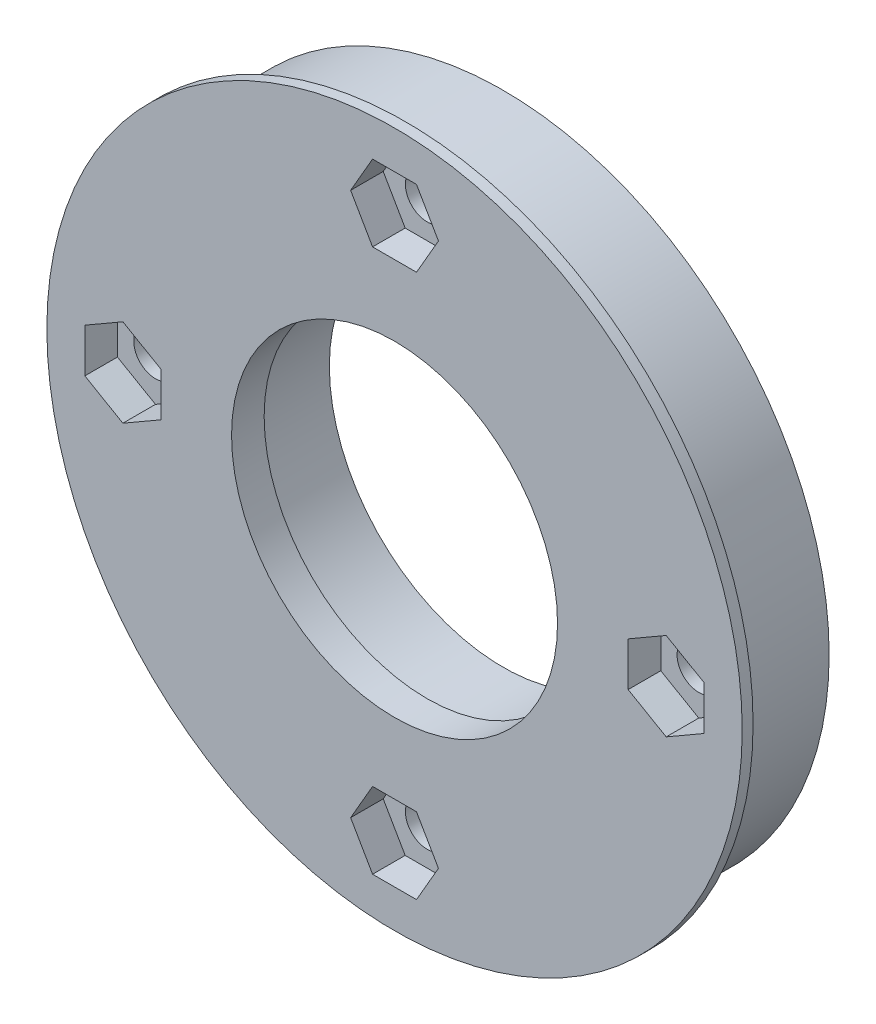
ISO-10303-21;
HEADER;
FILE_DESCRIPTION(('STEP AP214'),'2;1');
FILE_NAME('part.step','',(''),(''),'','','');
FILE_SCHEMA(('AUTOMOTIVE_DESIGN { 1 0 10303 214 1 1 1 1 }'));
ENDSEC;
DATA;
#1=APPLICATION_CONTEXT('core data for automotive mechanical design processes');
#2=APPLICATION_PROTOCOL_DEFINITION('international standard','automotive_design',2000,#1);
#3=PRODUCT_CONTEXT('',#1,'mechanical');
#4=PRODUCT('Part','Part','',(#3));
#5=PRODUCT_RELATED_PRODUCT_CATEGORY('part','',(#4));
#6=PRODUCT_DEFINITION_FORMATION('','',#4);
#7=PRODUCT_DEFINITION_CONTEXT('part definition',#1,'design');
#8=PRODUCT_DEFINITION('design','',#6,#7);
#9=PRODUCT_DEFINITION_SHAPE('','',#8);
#10=(LENGTH_UNIT() NAMED_UNIT(*) SI_UNIT(.MILLI.,.METRE.));
#11=(NAMED_UNIT(*) PLANE_ANGLE_UNIT() SI_UNIT($,.RADIAN.));
#12=(NAMED_UNIT(*) SI_UNIT($,.STERADIAN.) SOLID_ANGLE_UNIT());
#13=UNCERTAINTY_MEASURE_WITH_UNIT(LENGTH_MEASURE(1.E-05),#10,'distance_accuracy_value','');
#14=(GEOMETRIC_REPRESENTATION_CONTEXT(3) GLOBAL_UNCERTAINTY_ASSIGNED_CONTEXT((#13)) GLOBAL_UNIT_ASSIGNED_CONTEXT((#10,
#11,#12)) REPRESENTATION_CONTEXT('',''));
#15=CARTESIAN_POINT('',(0.,0.,0.));
#16=DIRECTION('',(0.,0.,1.));
#17=DIRECTION('',(1.,0.,0.));
#18=AXIS2_PLACEMENT_3D('',#15,#16,#17);
#19=CARTESIAN_POINT('',(25.,0.,-10.));
#20=DIRECTION('',(0.,0.,1.));
#21=DIRECTION('',(1.,0.,0.));
#22=AXIS2_PLACEMENT_3D('',#19,#20,#21);
#23=CYLINDRICAL_SURFACE('',#22,2.);
#24=CARTESIAN_POINT('',(25.,0.,-7.));
#25=DIRECTION('',(0.,0.,-1.));
#26=DIRECTION('',(-1.,0.,0.));
#27=AXIS2_PLACEMENT_3D('',#24,#25,#26);
#28=CIRCLE('',#27,2.);
#29=CARTESIAN_POINT('',(23.,0.,-7.));
#30=VERTEX_POINT('',#29);
#31=EDGE_CURVE('E505',#30,#30,#28,.F.);
#32=ORIENTED_EDGE('',*,*,#31,.F.);
#33=EDGE_LOOP('',(#32));
#34=FACE_BOUND('',#33,.T.);
#35=CARTESIAN_POINT('',(25.,0.,0.));
#36=DIRECTION('',(0.,0.,1.));
#37=DIRECTION('',(1.,0.,0.));
#38=AXIS2_PLACEMENT_3D('',#35,#36,#37);
#39=CIRCLE('',#38,2.);
#40=CARTESIAN_POINT('',(27.,0.,0.));
#41=VERTEX_POINT('',#40);
#42=EDGE_CURVE('E63',#41,#41,#39,.F.);
#43=ORIENTED_EDGE('',*,*,#42,.F.);
#44=EDGE_LOOP('',(#43));
#45=FACE_BOUND('',#44,.T.);
#46=ADVANCED_FACE('F59',(#34,#45),#23,.F.);
#47=CARTESIAN_POINT('',(0.,-25.,-10.));
#48=DIRECTION('',(0.,0.,1.));
#49=DIRECTION('',(1.,0.,0.));
#50=AXIS2_PLACEMENT_3D('',#47,#48,#49);
#51=CYLINDRICAL_SURFACE('',#50,2.00000000000001);
#52=CARTESIAN_POINT('',(0.,-25.,-7.));
#53=DIRECTION('',(0.,0.,-1.));
#54=DIRECTION('',(-1.,0.,0.));
#55=AXIS2_PLACEMENT_3D('',#52,#53,#54);
#56=CIRCLE('',#55,2.00000000000001);
#57=CARTESIAN_POINT('',(-2.00000000000001,-25.,-7.));
#58=VERTEX_POINT('',#57);
#59=EDGE_CURVE('E501',#58,#58,#56,.F.);
#60=ORIENTED_EDGE('',*,*,#59,.F.);
#61=EDGE_LOOP('',(#60));
#62=FACE_BOUND('',#61,.T.);
#63=CARTESIAN_POINT('',(0.,-25.,0.));
#64=DIRECTION('',(0.,0.,1.));
#65=DIRECTION('',(1.,0.,0.));
#66=AXIS2_PLACEMENT_3D('',#63,#64,#65);
#67=CIRCLE('',#66,2.00000000000001);
#68=CARTESIAN_POINT('',(2.,-25.,0.));
#69=VERTEX_POINT('',#68);
#70=EDGE_CURVE('E542',#69,#69,#67,.F.);
#71=ORIENTED_EDGE('',*,*,#70,.F.);
#72=EDGE_LOOP('',(#71));
#73=FACE_BOUND('',#72,.T.);
#74=ADVANCED_FACE('F552',(#62,#73),#51,.F.);
#75=CARTESIAN_POINT('',(-25.,0.,-10.));
#76=DIRECTION('',(0.,0.,1.));
#77=DIRECTION('',(1.,0.,0.));
#78=AXIS2_PLACEMENT_3D('',#75,#76,#77);
#79=CYLINDRICAL_SURFACE('',#78,2.);
#80=CARTESIAN_POINT('',(-25.,0.,-7.));
#81=DIRECTION('',(0.,0.,-1.));
#82=DIRECTION('',(-1.,0.,0.));
#83=AXIS2_PLACEMENT_3D('',#80,#81,#82);
#84=CIRCLE('',#83,2.);
#85=CARTESIAN_POINT('',(-27.,0.,-7.));
#86=VERTEX_POINT('',#85);
#87=EDGE_CURVE('E497',#86,#86,#84,.F.);
#88=ORIENTED_EDGE('',*,*,#87,.F.);
#89=EDGE_LOOP('',(#88));
#90=FACE_BOUND('',#89,.T.);
#91=CARTESIAN_POINT('',(-25.,0.,0.));
#92=DIRECTION('',(0.,0.,1.));
#93=DIRECTION('',(1.,0.,0.));
#94=AXIS2_PLACEMENT_3D('',#91,#92,#93);
#95=CIRCLE('',#94,2.);
#96=CARTESIAN_POINT('',(-23.,0.,0.));
#97=VERTEX_POINT('',#96);
#98=EDGE_CURVE('E539',#97,#97,#95,.F.);
#99=ORIENTED_EDGE('',*,*,#98,.F.);
#100=EDGE_LOOP('',(#99));
#101=FACE_BOUND('',#100,.T.);
#102=ADVANCED_FACE('F559',(#90,#101),#79,.F.);
#103=CARTESIAN_POINT('',(0.,25.,-10.));
#104=DIRECTION('',(0.,0.,1.));
#105=DIRECTION('',(1.,0.,0.));
#106=AXIS2_PLACEMENT_3D('',#103,#104,#105);
#107=CYLINDRICAL_SURFACE('',#106,2.00000000000001);
#108=CARTESIAN_POINT('',(0.,25.,-7.));
#109=DIRECTION('',(0.,0.,-1.));
#110=DIRECTION('',(-1.,0.,0.));
#111=AXIS2_PLACEMENT_3D('',#108,#109,#110);
#112=CIRCLE('',#111,2.00000000000001);
#113=CARTESIAN_POINT('',(-2.00000000000001,25.,-7.));
#114=VERTEX_POINT('',#113);
#115=EDGE_CURVE('E493',#114,#114,#112,.F.);
#116=ORIENTED_EDGE('',*,*,#115,.F.);
#117=EDGE_LOOP('',(#116));
#118=FACE_BOUND('',#117,.T.);
#119=CARTESIAN_POINT('',(0.,25.,0.));
#120=DIRECTION('',(0.,0.,1.));
#121=DIRECTION('',(1.,0.,0.));
#122=AXIS2_PLACEMENT_3D('',#119,#120,#121);
#123=CIRCLE('',#122,2.00000000000001);
#124=CARTESIAN_POINT('',(2.,25.,0.));
#125=VERTEX_POINT('',#124);
#126=EDGE_CURVE('E286',#125,#125,#123,.F.);
#127=ORIENTED_EDGE('',*,*,#126,.F.);
#128=EDGE_LOOP('',(#127));
#129=FACE_BOUND('',#128,.T.);
#130=ADVANCED_FACE('F569',(#118,#129),#107,.F.);
#131=CARTESIAN_POINT('',(0.,0.,-7.));
#132=DIRECTION('',(0.,0.,1.));
#133=DIRECTION('',(1.,0.,0.));
#134=AXIS2_PLACEMENT_3D('',#131,#132,#133);
#135=CYLINDRICAL_SURFACE('',#134,29.9974);
#136=CARTESIAN_POINT('',(0.,0.,2.));
#137=DIRECTION('',(0.,0.,1.));
#138=DIRECTION('',(1.,0.,0.));
#139=AXIS2_PLACEMENT_3D('',#136,#137,#138);
#140=CIRCLE('',#139,29.9974);
#141=CARTESIAN_POINT('',(29.9974,0.,2.));
#142=VERTEX_POINT('',#141);
#143=EDGE_CURVE('E526',#142,#142,#140,.F.);
#144=ORIENTED_EDGE('',*,*,#143,.T.);
#145=EDGE_LOOP('',(#144));
#146=FACE_BOUND('',#145,.T.);
#147=CARTESIAN_POINT('',(0.,0.,-7.));
#148=DIRECTION('',(0.,0.,1.));
#149=DIRECTION('',(1.,0.,0.));
#150=AXIS2_PLACEMENT_3D('',#147,#148,#149);
#151=CIRCLE('',#150,29.9974);
#152=CARTESIAN_POINT('',(29.9974,0.,-7.));
#153=VERTEX_POINT('',#152);
#154=EDGE_CURVE('E12',#153,#153,#151,.T.);
#155=ORIENTED_EDGE('',*,*,#154,.T.);
#156=EDGE_LOOP('',(#155));
#157=FACE_BOUND('',#156,.T.);
#158=ADVANCED_FACE('F573',(#146,#157),#135,.T.);
#159=CARTESIAN_POINT('',(0.,0.,-7.));
#160=DIRECTION('',(0.,0.,1.));
#161=DIRECTION('',(1.,0.,0.));
#162=AXIS2_PLACEMENT_3D('',#159,#160,#161);
#163=PLANE('',#162);
#164=CARTESIAN_POINT('',(0.,0.,-7.));
#165=DIRECTION('',(0.,0.,1.));
#166=DIRECTION('',(1.,0.,0.));
#167=AXIS2_PLACEMENT_3D('',#164,#165,#166);
#168=CIRCLE('',#167,16.);
#169=CARTESIAN_POINT('',(16.,0.,-7.));
#170=VERTEX_POINT('',#169);
#171=EDGE_CURVE('E69',#170,#170,#168,.T.);
#172=ORIENTED_EDGE('',*,*,#171,.T.);
#173=EDGE_LOOP('',(#172));
#174=FACE_BOUND('',#173,.T.);
#175=ORIENTED_EDGE('',*,*,#154,.F.);
#176=EDGE_LOOP('',(#175));
#177=FACE_BOUND('',#176,.T.);
#178=ORIENTED_EDGE('',*,*,#59,.T.);
#179=EDGE_LOOP('',(#178));
#180=FACE_BOUND('',#179,.T.);
#181=ORIENTED_EDGE('',*,*,#87,.T.);
#182=EDGE_LOOP('',(#181));
#183=FACE_BOUND('',#182,.T.);
#184=ORIENTED_EDGE('',*,*,#115,.T.);
#185=EDGE_LOOP('',(#184));
#186=FACE_BOUND('',#185,.T.);
#187=ORIENTED_EDGE('',*,*,#31,.T.);
#188=EDGE_LOOP('',(#187));
#189=FACE_BOUND('',#188,.T.);
#190=ADVANCED_FACE('F575',(#174,#177,#180,#183,#186,#189),#163,.F.);
#191=CARTESIAN_POINT('',(1.13985098899291E-13,-1.1836284832237E-13,-1.));
#192=DIRECTION('',(0.,0.,1.));
#193=DIRECTION('',(1.,0.,0.));
#194=AXIS2_PLACEMENT_3D('',#191,#192,#193);
#195=CYLINDRICAL_SURFACE('',#194,15.0000000000005);
#196=CARTESIAN_POINT('',(1.13985098899291E-13,-1.1836284832237E-13,0.));
#197=DIRECTION('',(0.,0.,-1.));
#198=DIRECTION('',(-1.,0.,0.));
#199=AXIS2_PLACEMENT_3D('',#196,#197,#198);
#200=CIRCLE('',#199,15.0000000000005);
#201=CARTESIAN_POINT('',(-15.0000000000004,-1.1836284832237E-13,0.));
#202=VERTEX_POINT('',#201);
#203=EDGE_CURVE('E513',#202,#202,#200,.T.);
#204=ORIENTED_EDGE('',*,*,#203,.T.);
#205=EDGE_LOOP('',(#204));
#206=FACE_BOUND('',#205,.T.);
#207=CARTESIAN_POINT('',(1.13985098899291E-13,-1.1836284832237E-13,3.));
#208=DIRECTION('',(0.,0.,1.));
#209=DIRECTION('',(1.,0.,0.));
#210=AXIS2_PLACEMENT_3D('',#207,#208,#209);
#211=CIRCLE('',#210,15.0000000000005);
#212=CARTESIAN_POINT('',(15.0000000000006,-1.1836284832237E-13,3.));
#213=VERTEX_POINT('',#212);
#214=EDGE_CURVE('E509',#213,#213,#211,.T.);
#215=ORIENTED_EDGE('',*,*,#214,.T.);
#216=EDGE_LOOP('',(#215));
#217=FACE_BOUND('',#216,.T.);
#218=ADVANCED_FACE('F564',(#206,#217),#195,.F.);
#219=CARTESIAN_POINT('',(0.,0.,-7.));
#220=DIRECTION('',(0.,0.,1.));
#221=DIRECTION('',(1.,0.,0.));
#222=AXIS2_PLACEMENT_3D('',#219,#220,#221);
#223=CYLINDRICAL_SURFACE('',#222,16.);
#224=ORIENTED_EDGE('',*,*,#171,.F.);
#225=EDGE_LOOP('',(#224));
#226=FACE_BOUND('',#225,.T.);
#227=CARTESIAN_POINT('',(0.,0.,0.));
#228=DIRECTION('',(0.,0.,-1.));
#229=DIRECTION('',(-1.,0.,0.));
#230=AXIS2_PLACEMENT_3D('',#227,#228,#229);
#231=CIRCLE('',#230,16.);
#232=CARTESIAN_POINT('',(-16.,0.,0.));
#233=VERTEX_POINT('',#232);
#234=EDGE_CURVE('E517',#233,#233,#231,.T.);
#235=ORIENTED_EDGE('',*,*,#234,.F.);
#236=EDGE_LOOP('',(#235));
#237=FACE_BOUND('',#236,.T.);
#238=ADVANCED_FACE('F61',(#226,#237),#223,.F.);
#239=CARTESIAN_POINT('',(0.,0.,3.));
#240=DIRECTION('',(0.,0.,1.));
#241=DIRECTION('',(1.,0.,0.));
#242=AXIS2_PLACEMENT_3D('',#239,#240,#241);
#243=PLANE('',#242);
#244=DIRECTION('',(0.866025403784439,-0.5,0.));
#245=VECTOR('',#244,1.);
#246=CARTESIAN_POINT('',(21.5,-2.02072594216369,3.));
#247=LINE('',#246,#245);
#248=CARTESIAN_POINT('',(21.5,-2.02072594216369,3.));
#249=VERTEX_POINT('',#248);
#250=CARTESIAN_POINT('',(25.,-4.04145188432739,3.));
#251=VERTEX_POINT('',#250);
#252=EDGE_CURVE('E77',#249,#251,#247,.T.);
#253=ORIENTED_EDGE('',*,*,#252,.F.);
#254=DIRECTION('',(0.,-1.,0.));
#255=VECTOR('',#254,1.);
#256=CARTESIAN_POINT('',(21.5,2.02072594216369,3.));
#257=LINE('',#256,#255);
#258=CARTESIAN_POINT('',(21.5,2.02072594216369,3.));
#259=VERTEX_POINT('',#258);
#260=EDGE_CURVE('E248',#259,#249,#257,.T.);
#261=ORIENTED_EDGE('',*,*,#260,.F.);
#262=DIRECTION('',(-0.866025403784438,-0.5,0.));
#263=VECTOR('',#262,1.);
#264=CARTESIAN_POINT('',(25.,4.04145188432739,3.));
#265=LINE('',#264,#263);
#266=CARTESIAN_POINT('',(25.,4.04145188432739,3.));
#267=VERTEX_POINT('',#266);
#268=EDGE_CURVE('E252',#267,#259,#265,.T.);
#269=ORIENTED_EDGE('',*,*,#268,.F.);
#270=DIRECTION('',(-0.866025403784439,0.5,0.));
#271=VECTOR('',#270,1.);
#272=CARTESIAN_POINT('',(28.5,2.0207259421637,3.));
#273=LINE('',#272,#271);
#274=CARTESIAN_POINT('',(28.5,2.0207259421637,3.));
#275=VERTEX_POINT('',#274);
#276=EDGE_CURVE('E276',#275,#267,#273,.T.);
#277=ORIENTED_EDGE('',*,*,#276,.F.);
#278=DIRECTION('',(0.,1.,0.));
#279=VECTOR('',#278,1.);
#280=CARTESIAN_POINT('',(28.5,-2.02072594216369,3.));
#281=LINE('',#280,#279);
#282=CARTESIAN_POINT('',(28.5,-2.02072594216369,3.));
#283=VERTEX_POINT('',#282);
#284=EDGE_CURVE('E272',#283,#275,#281,.T.);
#285=ORIENTED_EDGE('',*,*,#284,.F.);
#286=DIRECTION('',(0.866025403784438,0.5,0.));
#287=VECTOR('',#286,1.);
#288=CARTESIAN_POINT('',(25.,-4.04145188432738,3.));
#289=LINE('',#288,#287);
#290=EDGE_CURVE('E268',#251,#283,#289,.T.);
#291=ORIENTED_EDGE('',*,*,#290,.F.);
#292=EDGE_LOOP('',(#253,#261,#269,#277,#285,#291));
#293=FACE_BOUND('',#292,.T.);
#294=DIRECTION('',(-0.500000000000003,-0.866025403784437,0.));
#295=VECTOR('',#294,1.);
#296=CARTESIAN_POINT('',(-2.02072594216377,-21.5,3.));
#297=LINE('',#296,#295);
#298=CARTESIAN_POINT('',(-2.02072594216377,-21.5,3.));
#299=VERTEX_POINT('',#298);
#300=CARTESIAN_POINT('',(-4.04145188432748,-25.,3.));
#301=VERTEX_POINT('',#300);
#302=EDGE_CURVE('E85',#299,#301,#297,.T.);
#303=ORIENTED_EDGE('',*,*,#302,.F.);
#304=DIRECTION('',(-1.,0.,0.));
#305=VECTOR('',#304,1.);
#306=CARTESIAN_POINT('',(2.02072594216362,-21.5,3.));
#307=LINE('',#306,#305);
#308=CARTESIAN_POINT('',(2.02072594216362,-21.5,3.));
#309=VERTEX_POINT('',#308);
#310=EDGE_CURVE('E303',#309,#299,#307,.T.);
#311=ORIENTED_EDGE('',*,*,#310,.F.);
#312=DIRECTION('',(-0.499999999999997,0.86602540378444,0.));
#313=VECTOR('',#312,1.);
#314=CARTESIAN_POINT('',(4.0414518843273,-25.,3.));
#315=LINE('',#314,#313);
#316=CARTESIAN_POINT('',(4.0414518843273,-25.,3.));
#317=VERTEX_POINT('',#316);
#318=EDGE_CURVE('E339',#317,#309,#315,.T.);
#319=ORIENTED_EDGE('',*,*,#318,.F.);
#320=DIRECTION('',(0.500000000000003,0.866025403784437,0.));
#321=VECTOR('',#320,1.);
#322=CARTESIAN_POINT('',(2.0207259421636,-28.5,3.));
#323=LINE('',#322,#321);
#324=CARTESIAN_POINT('',(2.0207259421636,-28.5,3.));
#325=VERTEX_POINT('',#324);
#326=EDGE_CURVE('E335',#325,#317,#323,.T.);
#327=ORIENTED_EDGE('',*,*,#326,.F.);
#328=DIRECTION('',(1.,0.,0.));
#329=VECTOR('',#328,1.);
#330=CARTESIAN_POINT('',(-2.02072594216379,-28.5,3.));
#331=LINE('',#330,#329);
#332=CARTESIAN_POINT('',(-2.02072594216379,-28.5,3.));
#333=VERTEX_POINT('',#332);
#334=EDGE_CURVE('E331',#333,#325,#331,.T.);
#335=ORIENTED_EDGE('',*,*,#334,.F.);
#336=DIRECTION('',(0.499999999999998,-0.86602540378444,0.));
#337=VECTOR('',#336,1.);
#338=CARTESIAN_POINT('',(-4.04145188432747,-25.,3.));
#339=LINE('',#338,#337);
#340=EDGE_CURVE('E326',#301,#333,#339,.T.);
#341=ORIENTED_EDGE('',*,*,#340,.F.);
#342=EDGE_LOOP('',(#303,#311,#319,#327,#335,#341));
#343=FACE_BOUND('',#342,.T.);
#344=DIRECTION('',(-0.866025403784439,0.5,0.));
#345=VECTOR('',#344,1.);
#346=CARTESIAN_POINT('',(-21.5,2.02072594216308,3.));
#347=LINE('',#346,#345);
#348=CARTESIAN_POINT('',(-21.5,2.02072594216308,3.));
#349=VERTEX_POINT('',#348);
#350=CARTESIAN_POINT('',(-24.9999999999999,4.04145188432677,3.));
#351=VERTEX_POINT('',#350);
#352=EDGE_CURVE('E388',#349,#351,#347,.T.);
#353=ORIENTED_EDGE('',*,*,#352,.F.);
#354=DIRECTION('',(0.,1.,0.));
#355=VECTOR('',#354,1.);
#356=CARTESIAN_POINT('',(-21.5,-2.0207259421643,3.));
#357=LINE('',#356,#355);
#358=CARTESIAN_POINT('',(-21.5,-2.0207259421643,3.));
#359=VERTEX_POINT('',#358);
#360=EDGE_CURVE('E367',#359,#349,#357,.T.);
#361=ORIENTED_EDGE('',*,*,#360,.F.);
#362=DIRECTION('',(0.866025403784439,0.5,0.));
#363=VECTOR('',#362,1.);
#364=CARTESIAN_POINT('',(-25.,-4.04145188432799,3.));
#365=LINE('',#364,#363);
#366=CARTESIAN_POINT('',(-25.,-4.04145188432799,3.));
#367=VERTEX_POINT('',#366);
#368=EDGE_CURVE('E404',#367,#359,#365,.T.);
#369=ORIENTED_EDGE('',*,*,#368,.F.);
#370=DIRECTION('',(0.866025403784439,-0.5,0.));
#371=VECTOR('',#370,1.);
#372=CARTESIAN_POINT('',(-28.4999999999999,-2.02072594216431,3.));
#373=LINE('',#372,#371);
#374=CARTESIAN_POINT('',(-28.4999999999999,-2.02072594216431,3.));
#375=VERTEX_POINT('',#374);
#376=EDGE_CURVE('E400',#375,#367,#373,.T.);
#377=ORIENTED_EDGE('',*,*,#376,.F.);
#378=DIRECTION('',(0.,-1.,0.));
#379=VECTOR('',#378,1.);
#380=CARTESIAN_POINT('',(-28.4999999999999,2.02072594216307,3.));
#381=LINE('',#380,#379);
#382=CARTESIAN_POINT('',(-28.4999999999999,2.02072594216307,3.));
#383=VERTEX_POINT('',#382);
#384=EDGE_CURVE('E396',#383,#375,#381,.T.);
#385=ORIENTED_EDGE('',*,*,#384,.F.);
#386=DIRECTION('',(-0.866025403784438,-0.5,0.));
#387=VECTOR('',#386,1.);
#388=CARTESIAN_POINT('',(-24.9999999999999,4.04145188432676,3.));
#389=LINE('',#388,#387);
#390=EDGE_CURVE('E391',#351,#383,#389,.T.);
#391=ORIENTED_EDGE('',*,*,#390,.F.);
#392=EDGE_LOOP('',(#353,#361,#369,#377,#385,#391));
#393=FACE_BOUND('',#392,.T.);
#394=DIRECTION('',(0.500000000000009,0.866025403784433,0.));
#395=VECTOR('',#394,1.);
#396=CARTESIAN_POINT('',(2.02072594216392,21.5,3.));
#397=LINE('',#396,#395);
#398=CARTESIAN_POINT('',(2.02072594216392,21.5,3.));
#399=VERTEX_POINT('',#398);
#400=CARTESIAN_POINT('',(4.04145188432765,25.,3.));
#401=VERTEX_POINT('',#400);
#402=EDGE_CURVE('E454',#399,#401,#397,.T.);
#403=ORIENTED_EDGE('',*,*,#402,.F.);
#404=DIRECTION('',(1.,0.,0.));
#405=VECTOR('',#404,1.);
#406=CARTESIAN_POINT('',(-2.02072594216347,21.5,3.));
#407=LINE('',#406,#405);
#408=CARTESIAN_POINT('',(-2.02072594216347,21.5,3.));
#409=VERTEX_POINT('',#408);
#410=EDGE_CURVE('E433',#409,#399,#407,.T.);
#411=ORIENTED_EDGE('',*,*,#410,.F.);
#412=DIRECTION('',(0.50000000000013,-0.866025403784364,0.));
#413=VECTOR('',#412,1.);
#414=CARTESIAN_POINT('',(-4.04145188432766,24.9999999999997,3.));
#415=LINE('',#414,#413);
#416=CARTESIAN_POINT('',(-4.04145188432766,24.9999999999997,3.));
#417=VERTEX_POINT('',#416);
#418=EDGE_CURVE('E469',#417,#409,#415,.T.);
#419=ORIENTED_EDGE('',*,*,#418,.F.);
#420=DIRECTION('',(-0.5,-0.866025403784439,0.));
#421=VECTOR('',#420,1.);
#422=CARTESIAN_POINT('',(-2.02072594216398,28.4999999999997,3.));
#423=LINE('',#422,#421);
#424=CARTESIAN_POINT('',(-2.02072594216398,28.4999999999997,3.));
#425=VERTEX_POINT('',#424);
#426=EDGE_CURVE('E465',#425,#417,#423,.T.);
#427=ORIENTED_EDGE('',*,*,#426,.F.);
#428=DIRECTION('',(-1.,0.,0.));
#429=VECTOR('',#428,1.);
#430=CARTESIAN_POINT('',(2.0207259421634,28.4999999999997,3.));
#431=LINE('',#430,#429);
#432=CARTESIAN_POINT('',(2.0207259421634,28.4999999999997,3.));
#433=VERTEX_POINT('',#432);
#434=EDGE_CURVE('E461',#433,#425,#431,.T.);
#435=ORIENTED_EDGE('',*,*,#434,.F.);
#436=DIRECTION('',(-0.500000000000134,0.866025403784361,0.));
#437=VECTOR('',#436,1.);
#438=CARTESIAN_POINT('',(4.04145188432765,25.,3.));
#439=LINE('',#438,#437);
#440=EDGE_CURVE('E457',#401,#433,#439,.T.);
#441=ORIENTED_EDGE('',*,*,#440,.F.);
#442=EDGE_LOOP('',(#403,#411,#419,#427,#435,#441));
#443=FACE_BOUND('',#442,.T.);
#444=CARTESIAN_POINT('',(0.,0.,3.));
#445=DIRECTION('',(0.,0.,1.));
#446=DIRECTION('',(1.,0.,0.));
#447=AXIS2_PLACEMENT_3D('',#444,#445,#446);
#448=CIRCLE('',#447,31.9974);
#449=CARTESIAN_POINT('',(31.9974,0.,3.));
#450=VERTEX_POINT('',#449);
#451=EDGE_CURVE('E521',#450,#450,#448,.T.);
#452=ORIENTED_EDGE('',*,*,#451,.T.);
#453=EDGE_LOOP('',(#452));
#454=FACE_BOUND('',#453,.T.);
#455=ORIENTED_EDGE('',*,*,#214,.F.);
#456=EDGE_LOOP('',(#455));
#457=FACE_BOUND('',#456,.T.);
#458=ADVANCED_FACE('F640',(#293,#343,#393,#443,#454,#457),#243,.T.);
#459=CARTESIAN_POINT('',(0.,0.,2.));
#460=DIRECTION('',(0.,0.,1.));
#461=DIRECTION('',(1.,0.,0.));
#462=AXIS2_PLACEMENT_3D('',#459,#460,#461);
#463=PLANE('',#462);
#464=ORIENTED_EDGE('',*,*,#143,.F.);
#465=EDGE_LOOP('',(#464));
#466=FACE_BOUND('',#465,.T.);
#467=CARTESIAN_POINT('',(0.,0.,2.));
#468=DIRECTION('',(0.,0.,1.));
#469=DIRECTION('',(1.,0.,0.));
#470=AXIS2_PLACEMENT_3D('',#467,#468,#469);
#471=CIRCLE('',#470,31.9974);
#472=CARTESIAN_POINT('',(31.9974,0.,2.));
#473=VERTEX_POINT('',#472);
#474=EDGE_CURVE('E522',#473,#473,#471,.T.);
#475=ORIENTED_EDGE('',*,*,#474,.F.);
#476=EDGE_LOOP('',(#475));
#477=FACE_BOUND('',#476,.T.);
#478=ADVANCED_FACE('F637',(#466,#477),#463,.F.);
#479=CARTESIAN_POINT('',(0.,0.,2.));
#480=DIRECTION('',(0.,0.,1.));
#481=DIRECTION('',(1.,0.,0.));
#482=AXIS2_PLACEMENT_3D('',#479,#480,#481);
#483=CYLINDRICAL_SURFACE('',#482,31.9974);
#484=ORIENTED_EDGE('',*,*,#474,.T.);
#485=EDGE_LOOP('',(#484));
#486=FACE_BOUND('',#485,.T.);
#487=ORIENTED_EDGE('',*,*,#451,.F.);
#488=EDGE_LOOP('',(#487));
#489=FACE_BOUND('',#488,.T.);
#490=ADVANCED_FACE('F610',(#486,#489),#483,.T.);
#491=CARTESIAN_POINT('',(0.,0.,0.));
#492=DIRECTION('',(0.,0.,-1.));
#493=DIRECTION('',(-1.,0.,0.));
#494=AXIS2_PLACEMENT_3D('',#491,#492,#493);
#495=PLANE('',#494);
#496=ORIENTED_EDGE('',*,*,#203,.F.);
#497=EDGE_LOOP('',(#496));
#498=FACE_BOUND('',#497,.T.);
#499=ORIENTED_EDGE('',*,*,#234,.T.);
#500=EDGE_LOOP('',(#499));
#501=FACE_BOUND('',#500,.T.);
#502=ADVANCED_FACE('F599',(#498,#501),#495,.T.);
#503=CARTESIAN_POINT('',(0.,0.,0.));
#504=DIRECTION('',(0.,0.,1.));
#505=DIRECTION('',(1.,0.,0.));
#506=AXIS2_PLACEMENT_3D('',#503,#504,#505);
#507=PLANE('',#506);
#508=DIRECTION('',(0.500000000000009,0.866025403784433,0.));
#509=VECTOR('',#508,1.);
#510=CARTESIAN_POINT('',(2.02072594216392,21.5,0.));
#511=LINE('',#510,#509);
#512=CARTESIAN_POINT('',(2.02072594216392,21.5,0.));
#513=VERTEX_POINT('',#512);
#514=CARTESIAN_POINT('',(4.04145188432765,25.,0.));
#515=VERTEX_POINT('',#514);
#516=EDGE_CURVE('E428',#513,#515,#511,.T.);
#517=ORIENTED_EDGE('',*,*,#516,.T.);
#518=DIRECTION('',(-0.500000000000134,0.866025403784361,0.));
#519=VECTOR('',#518,1.);
#520=CARTESIAN_POINT('',(4.04145188432765,25.,0.));
#521=LINE('',#520,#519);
#522=CARTESIAN_POINT('',(2.0207259421634,28.4999999999997,0.));
#523=VERTEX_POINT('',#522);
#524=EDGE_CURVE('E432',#515,#523,#521,.T.);
#525=ORIENTED_EDGE('',*,*,#524,.T.);
#526=DIRECTION('',(-1.,0.,0.));
#527=VECTOR('',#526,1.);
#528=CARTESIAN_POINT('',(2.0207259421634,28.4999999999997,0.));
#529=LINE('',#528,#527);
#530=CARTESIAN_POINT('',(-2.02072594216398,28.4999999999997,0.));
#531=VERTEX_POINT('',#530);
#532=EDGE_CURVE('E437',#523,#531,#529,.T.);
#533=ORIENTED_EDGE('',*,*,#532,.T.);
#534=DIRECTION('',(-0.5,-0.866025403784439,0.));
#535=VECTOR('',#534,1.);
#536=CARTESIAN_POINT('',(-2.02072594216398,28.4999999999997,0.));
#537=LINE('',#536,#535);
#538=CARTESIAN_POINT('',(-4.04145188432766,24.9999999999997,0.));
#539=VERTEX_POINT('',#538);
#540=EDGE_CURVE('E441',#531,#539,#537,.T.);
#541=ORIENTED_EDGE('',*,*,#540,.T.);
#542=DIRECTION('',(0.50000000000013,-0.866025403784364,0.));
#543=VECTOR('',#542,1.);
#544=CARTESIAN_POINT('',(-4.04145188432766,24.9999999999997,0.));
#545=LINE('',#544,#543);
#546=CARTESIAN_POINT('',(-2.02072594216347,21.5,0.));
#547=VERTEX_POINT('',#546);
#548=EDGE_CURVE('E445',#539,#547,#545,.T.);
#549=ORIENTED_EDGE('',*,*,#548,.T.);
#550=DIRECTION('',(1.,0.,0.));
#551=VECTOR('',#550,1.);
#552=CARTESIAN_POINT('',(-2.02072594216347,21.5,0.));
#553=LINE('',#552,#551);
#554=EDGE_CURVE('E449',#547,#513,#553,.T.);
#555=ORIENTED_EDGE('',*,*,#554,.T.);
#556=EDGE_LOOP('',(#517,#525,#533,#541,#549,#555));
#557=FACE_BOUND('',#556,.T.);
#558=ORIENTED_EDGE('',*,*,#126,.T.);
#559=EDGE_LOOP('',(#558));
#560=FACE_BOUND('',#559,.T.);
#561=ADVANCED_FACE('F596',(#557,#560),#507,.T.);
#562=CARTESIAN_POINT('',(2.02072594216392,21.5,0.));
#563=DIRECTION('',(0.866025403784433,-0.500000000000009,0.));
#564=DIRECTION('',(0.500000000000009,0.866025403784433,0.));
#565=AXIS2_PLACEMENT_3D('',#562,#563,#564);
#566=PLANE('',#565);
#567=ORIENTED_EDGE('',*,*,#402,.T.);
#568=DIRECTION('',(0.,0.,1.));
#569=VECTOR('',#568,1.);
#570=CARTESIAN_POINT('',(4.04145188432765,25.,0.));
#571=LINE('',#570,#569);
#572=EDGE_CURVE('E453',#515,#401,#571,.T.);
#573=ORIENTED_EDGE('',*,*,#572,.F.);
#574=ORIENTED_EDGE('',*,*,#516,.F.);
#575=DIRECTION('',(0.,0.,1.));
#576=VECTOR('',#575,1.);
#577=CARTESIAN_POINT('',(2.02072594216392,21.5,0.));
#578=LINE('',#577,#576);
#579=EDGE_CURVE('E392',#513,#399,#578,.T.);
#580=ORIENTED_EDGE('',*,*,#579,.T.);
#581=EDGE_LOOP('',(#567,#573,#574,#580));
#582=FACE_BOUND('',#581,.T.);
#583=ADVANCED_FACE('F598',(#582),#566,.F.);
#584=CARTESIAN_POINT('',(-2.02072594216347,21.5,0.));
#585=DIRECTION('',(0.,-1.,0.));
#586=DIRECTION('',(1.,0.,0.));
#587=AXIS2_PLACEMENT_3D('',#584,#585,#586);
#588=PLANE('',#587);
#589=ORIENTED_EDGE('',*,*,#410,.T.);
#590=ORIENTED_EDGE('',*,*,#579,.F.);
#591=ORIENTED_EDGE('',*,*,#554,.F.);
#592=DIRECTION('',(0.,0.,1.));
#593=VECTOR('',#592,1.);
#594=CARTESIAN_POINT('',(-2.02072594216347,21.5,0.));
#595=LINE('',#594,#593);
#596=EDGE_CURVE('E478',#547,#409,#595,.T.);
#597=ORIENTED_EDGE('',*,*,#596,.T.);
#598=EDGE_LOOP('',(#589,#590,#591,#597));
#599=FACE_BOUND('',#598,.T.);
#600=ADVANCED_FACE('F606',(#599),#588,.F.);
#601=CARTESIAN_POINT('',(-4.04145188432766,24.9999999999997,0.));
#602=DIRECTION('',(-0.866025403784363,-0.50000000000013,0.));
#603=DIRECTION('',(0.50000000000013,-0.866025403784363,0.));
#604=AXIS2_PLACEMENT_3D('',#601,#602,#603);
#605=PLANE('',#604);
#606=ORIENTED_EDGE('',*,*,#418,.T.);
#607=ORIENTED_EDGE('',*,*,#596,.F.);
#608=ORIENTED_EDGE('',*,*,#548,.F.);
#609=DIRECTION('',(0.,0.,1.));
#610=VECTOR('',#609,1.);
#611=CARTESIAN_POINT('',(-4.04145188432766,24.9999999999997,0.));
#612=LINE('',#611,#610);
#613=EDGE_CURVE('E481',#539,#417,#612,.T.);
#614=ORIENTED_EDGE('',*,*,#613,.T.);
#615=EDGE_LOOP('',(#606,#607,#608,#614));
#616=FACE_BOUND('',#615,.T.);
#617=ADVANCED_FACE('F619',(#616),#605,.F.);
#618=CARTESIAN_POINT('',(-2.02072594216398,28.4999999999997,0.));
#619=DIRECTION('',(-0.866025403784439,0.5,0.));
#620=DIRECTION('',(-0.5,-0.866025403784439,0.));
#621=AXIS2_PLACEMENT_3D('',#618,#619,#620);
#622=PLANE('',#621);
#623=ORIENTED_EDGE('',*,*,#426,.T.);
#624=ORIENTED_EDGE('',*,*,#613,.F.);
#625=ORIENTED_EDGE('',*,*,#540,.F.);
#626=DIRECTION('',(0.,0.,1.));
#627=VECTOR('',#626,1.);
#628=CARTESIAN_POINT('',(-2.02072594216398,28.4999999999997,0.));
#629=LINE('',#628,#627);
#630=EDGE_CURVE('E484',#531,#425,#629,.T.);
#631=ORIENTED_EDGE('',*,*,#630,.T.);
#632=EDGE_LOOP('',(#623,#624,#625,#631));
#633=FACE_BOUND('',#632,.T.);
#634=ADVANCED_FACE('F623',(#633),#622,.F.);
#635=CARTESIAN_POINT('',(2.0207259421634,28.4999999999997,0.));
#636=DIRECTION('',(0.,1.,0.));
#637=DIRECTION('',(0.,0.,1.));
#638=AXIS2_PLACEMENT_3D('',#635,#636,#637);
#639=PLANE('',#638);
#640=ORIENTED_EDGE('',*,*,#434,.T.);
#641=ORIENTED_EDGE('',*,*,#630,.F.);
#642=ORIENTED_EDGE('',*,*,#532,.F.);
#643=DIRECTION('',(0.,0.,1.));
#644=VECTOR('',#643,1.);
#645=CARTESIAN_POINT('',(2.0207259421634,28.4999999999997,0.));
#646=LINE('',#645,#644);
#647=EDGE_CURVE('E487',#523,#433,#646,.T.);
#648=ORIENTED_EDGE('',*,*,#647,.T.);
#649=EDGE_LOOP('',(#640,#641,#642,#648));
#650=FACE_BOUND('',#649,.T.);
#651=ADVANCED_FACE('F627',(#650),#639,.F.);
#652=CARTESIAN_POINT('',(4.04145188432765,25.,0.));
#653=DIRECTION('',(0.866025403784361,0.500000000000134,0.));
#654=DIRECTION('',(-0.500000000000134,0.866025403784361,0.));
#655=AXIS2_PLACEMENT_3D('',#652,#653,#654);
#656=PLANE('',#655);
#657=ORIENTED_EDGE('',*,*,#440,.T.);
#658=ORIENTED_EDGE('',*,*,#647,.F.);
#659=ORIENTED_EDGE('',*,*,#524,.F.);
#660=ORIENTED_EDGE('',*,*,#572,.T.);
#661=EDGE_LOOP('',(#657,#658,#659,#660));
#662=FACE_BOUND('',#661,.T.);
#663=ADVANCED_FACE('F631',(#662),#656,.F.);
#664=CARTESIAN_POINT('',(0.,0.,0.));
#665=DIRECTION('',(0.,0.,1.));
#666=DIRECTION('',(1.,0.,0.));
#667=AXIS2_PLACEMENT_3D('',#664,#665,#666);
#668=PLANE('',#667);
#669=DIRECTION('',(-0.866025403784439,0.5,0.));
#670=VECTOR('',#669,1.);
#671=CARTESIAN_POINT('',(-21.5,2.02072594216308,0.));
#672=LINE('',#671,#670);
#673=CARTESIAN_POINT('',(-21.5,2.02072594216308,0.));
#674=VERTEX_POINT('',#673);
#675=CARTESIAN_POINT('',(-24.9999999999999,4.04145188432676,0.));
#676=VERTEX_POINT('',#675);
#677=EDGE_CURVE('E362',#674,#676,#672,.T.);
#678=ORIENTED_EDGE('',*,*,#677,.T.);
#679=DIRECTION('',(-0.866025403784438,-0.5,0.));
#680=VECTOR('',#679,1.);
#681=CARTESIAN_POINT('',(-24.9999999999999,4.04145188432676,0.));
#682=LINE('',#681,#680);
#683=CARTESIAN_POINT('',(-28.4999999999999,2.02072594216307,0.));
#684=VERTEX_POINT('',#683);
#685=EDGE_CURVE('E366',#676,#684,#682,.T.);
#686=ORIENTED_EDGE('',*,*,#685,.T.);
#687=DIRECTION('',(0.,-1.,0.));
#688=VECTOR('',#687,1.);
#689=CARTESIAN_POINT('',(-28.4999999999999,2.02072594216307,0.));
#690=LINE('',#689,#688);
#691=CARTESIAN_POINT('',(-28.4999999999999,-2.02072594216431,0.));
#692=VERTEX_POINT('',#691);
#693=EDGE_CURVE('E371',#684,#692,#690,.T.);
#694=ORIENTED_EDGE('',*,*,#693,.T.);
#695=DIRECTION('',(0.866025403784439,-0.5,0.));
#696=VECTOR('',#695,1.);
#697=CARTESIAN_POINT('',(-28.4999999999999,-2.02072594216431,0.));
#698=LINE('',#697,#696);
#699=CARTESIAN_POINT('',(-25.,-4.04145188432799,0.));
#700=VERTEX_POINT('',#699);
#701=EDGE_CURVE('E375',#692,#700,#698,.T.);
#702=ORIENTED_EDGE('',*,*,#701,.T.);
#703=DIRECTION('',(0.866025403784439,0.5,0.));
#704=VECTOR('',#703,1.);
#705=CARTESIAN_POINT('',(-25.,-4.04145188432799,0.));
#706=LINE('',#705,#704);
#707=CARTESIAN_POINT('',(-21.5,-2.0207259421643,0.));
#708=VERTEX_POINT('',#707);
#709=EDGE_CURVE('E379',#700,#708,#706,.T.);
#710=ORIENTED_EDGE('',*,*,#709,.T.);
#711=DIRECTION('',(0.,1.,0.));
#712=VECTOR('',#711,1.);
#713=CARTESIAN_POINT('',(-21.5,-2.0207259421643,0.));
#714=LINE('',#713,#712);
#715=EDGE_CURVE('E383',#708,#674,#714,.T.);
#716=ORIENTED_EDGE('',*,*,#715,.T.);
#717=EDGE_LOOP('',(#678,#686,#694,#702,#710,#716));
#718=FACE_BOUND('',#717,.T.);
#719=ORIENTED_EDGE('',*,*,#98,.T.);
#720=EDGE_LOOP('',(#719));
#721=FACE_BOUND('',#720,.T.);
#722=ADVANCED_FACE('F634',(#718,#721),#668,.T.);
#723=CARTESIAN_POINT('',(-21.5,2.02072594216308,0.));
#724=DIRECTION('',(0.5,0.866025403784439,0.));
#725=DIRECTION('',(-0.866025403784439,0.5,0.));
#726=AXIS2_PLACEMENT_3D('',#723,#724,#725);
#727=PLANE('',#726);
#728=ORIENTED_EDGE('',*,*,#352,.T.);
#729=DIRECTION('',(0.,0.,1.));
#730=VECTOR('',#729,1.);
#731=CARTESIAN_POINT('',(-24.9999999999999,4.04145188432676,0.));
#732=LINE('',#731,#730);
#733=EDGE_CURVE('E387',#676,#351,#732,.T.);
#734=ORIENTED_EDGE('',*,*,#733,.F.);
#735=ORIENTED_EDGE('',*,*,#677,.F.);
#736=DIRECTION('',(0.,0.,1.));
#737=VECTOR('',#736,1.);
#738=CARTESIAN_POINT('',(-21.5,2.02072594216308,0.));
#739=LINE('',#738,#737);
#740=EDGE_CURVE('E327',#674,#349,#739,.T.);
#741=ORIENTED_EDGE('',*,*,#740,.T.);
#742=EDGE_LOOP('',(#728,#734,#735,#741));
#743=FACE_BOUND('',#742,.T.);
#744=ADVANCED_FACE('F615',(#743),#727,.F.);
#745=CARTESIAN_POINT('',(-21.5,-2.0207259421643,0.));
#746=DIRECTION('',(1.,0.,0.));
#747=DIRECTION('',(0.,0.,-1.));
#748=AXIS2_PLACEMENT_3D('',#745,#746,#747);
#749=PLANE('',#748);
#750=ORIENTED_EDGE('',*,*,#360,.T.);
#751=ORIENTED_EDGE('',*,*,#740,.F.);
#752=ORIENTED_EDGE('',*,*,#715,.F.);
#753=DIRECTION('',(0.,0.,1.));
#754=VECTOR('',#753,1.);
#755=CARTESIAN_POINT('',(-21.5,-2.0207259421643,0.));
#756=LINE('',#755,#754);
#757=EDGE_CURVE('E413',#708,#359,#756,.T.);
#758=ORIENTED_EDGE('',*,*,#757,.T.);
#759=EDGE_LOOP('',(#750,#751,#752,#758));
#760=FACE_BOUND('',#759,.T.);
#761=ADVANCED_FACE('F794',(#760),#749,.F.);
#762=CARTESIAN_POINT('',(-25.,-4.04145188432799,0.));
#763=DIRECTION('',(0.5,-0.866025403784439,0.));
#764=DIRECTION('',(0.866025403784439,0.5,0.));
#765=AXIS2_PLACEMENT_3D('',#762,#763,#764);
#766=PLANE('',#765);
#767=ORIENTED_EDGE('',*,*,#368,.T.);
#768=ORIENTED_EDGE('',*,*,#757,.F.);
#769=ORIENTED_EDGE('',*,*,#709,.F.);
#770=DIRECTION('',(0.,0.,1.));
#771=VECTOR('',#770,1.);
#772=CARTESIAN_POINT('',(-25.,-4.04145188432799,0.));
#773=LINE('',#772,#771);
#774=EDGE_CURVE('E416',#700,#367,#773,.T.);
#775=ORIENTED_EDGE('',*,*,#774,.T.);
#776=EDGE_LOOP('',(#767,#768,#769,#775));
#777=FACE_BOUND('',#776,.T.);
#778=ADVANCED_FACE('F802',(#777),#766,.F.);
#779=CARTESIAN_POINT('',(-28.4999999999999,-2.02072594216431,0.));
#780=DIRECTION('',(-0.5,-0.866025403784439,0.));
#781=DIRECTION('',(0.866025403784439,-0.5,0.));
#782=AXIS2_PLACEMENT_3D('',#779,#780,#781);
#783=PLANE('',#782);
#784=ORIENTED_EDGE('',*,*,#376,.T.);
#785=ORIENTED_EDGE('',*,*,#774,.F.);
#786=ORIENTED_EDGE('',*,*,#701,.F.);
#787=DIRECTION('',(0.,0.,1.));
#788=VECTOR('',#787,1.);
#789=CARTESIAN_POINT('',(-28.4999999999999,-2.02072594216431,0.));
#790=LINE('',#789,#788);
#791=EDGE_CURVE('E419',#692,#375,#790,.T.);
#792=ORIENTED_EDGE('',*,*,#791,.T.);
#793=EDGE_LOOP('',(#784,#785,#786,#792));
#794=FACE_BOUND('',#793,.T.);
#795=ADVANCED_FACE('F811',(#794),#783,.F.);
#796=CARTESIAN_POINT('',(-28.4999999999999,2.02072594216307,0.));
#797=DIRECTION('',(-1.,0.,0.));
#798=DIRECTION('',(0.,0.,1.));
#799=AXIS2_PLACEMENT_3D('',#796,#797,#798);
#800=PLANE('',#799);
#801=ORIENTED_EDGE('',*,*,#384,.T.);
#802=ORIENTED_EDGE('',*,*,#791,.F.);
#803=ORIENTED_EDGE('',*,*,#693,.F.);
#804=DIRECTION('',(0.,0.,1.));
#805=VECTOR('',#804,1.);
#806=CARTESIAN_POINT('',(-28.4999999999999,2.02072594216307,0.));
#807=LINE('',#806,#805);
#808=EDGE_CURVE('E422',#684,#383,#807,.T.);
#809=ORIENTED_EDGE('',*,*,#808,.T.);
#810=EDGE_LOOP('',(#801,#802,#803,#809));
#811=FACE_BOUND('',#810,.T.);
#812=ADVANCED_FACE('F820',(#811),#800,.F.);
#813=CARTESIAN_POINT('',(-24.9999999999999,4.04145188432676,0.));
#814=DIRECTION('',(-0.5,0.866025403784438,0.));
#815=DIRECTION('',(-0.866025403784439,-0.5,0.));
#816=AXIS2_PLACEMENT_3D('',#813,#814,#815);
#817=PLANE('',#816);
#818=ORIENTED_EDGE('',*,*,#390,.T.);
#819=ORIENTED_EDGE('',*,*,#808,.F.);
#820=ORIENTED_EDGE('',*,*,#685,.F.);
#821=ORIENTED_EDGE('',*,*,#733,.T.);
#822=EDGE_LOOP('',(#818,#819,#820,#821));
#823=FACE_BOUND('',#822,.T.);
#824=ADVANCED_FACE('F829',(#823),#817,.F.);
#825=CARTESIAN_POINT('',(0.,0.,0.));
#826=DIRECTION('',(0.,0.,1.));
#827=DIRECTION('',(1.,0.,0.));
#828=AXIS2_PLACEMENT_3D('',#825,#826,#827);
#829=PLANE('',#828);
#830=DIRECTION('',(-0.500000000000003,-0.866025403784437,0.));
#831=VECTOR('',#830,1.);
#832=CARTESIAN_POINT('',(-2.02072594216377,-21.5,0.));
#833=LINE('',#832,#831);
#834=CARTESIAN_POINT('',(-2.02072594216377,-21.5,0.));
#835=VERTEX_POINT('',#834);
#836=CARTESIAN_POINT('',(-4.04145188432747,-25.,0.));
#837=VERTEX_POINT('',#836);
#838=EDGE_CURVE('E298',#835,#837,#833,.T.);
#839=ORIENTED_EDGE('',*,*,#838,.T.);
#840=DIRECTION('',(0.499999999999998,-0.86602540378444,0.));
#841=VECTOR('',#840,1.);
#842=CARTESIAN_POINT('',(-4.04145188432747,-25.,0.));
#843=LINE('',#842,#841);
#844=CARTESIAN_POINT('',(-2.02072594216379,-28.5,0.));
#845=VERTEX_POINT('',#844);
#846=EDGE_CURVE('E302',#837,#845,#843,.T.);
#847=ORIENTED_EDGE('',*,*,#846,.T.);
#848=DIRECTION('',(1.,0.,0.));
#849=VECTOR('',#848,1.);
#850=CARTESIAN_POINT('',(-2.02072594216379,-28.5,0.));
#851=LINE('',#850,#849);
#852=CARTESIAN_POINT('',(2.0207259421636,-28.5,0.));
#853=VERTEX_POINT('',#852);
#854=EDGE_CURVE('E307',#845,#853,#851,.T.);
#855=ORIENTED_EDGE('',*,*,#854,.T.);
#856=DIRECTION('',(0.500000000000003,0.866025403784437,0.));
#857=VECTOR('',#856,1.);
#858=CARTESIAN_POINT('',(2.0207259421636,-28.5,0.));
#859=LINE('',#858,#857);
#860=CARTESIAN_POINT('',(4.0414518843273,-25.,0.));
#861=VERTEX_POINT('',#860);
#862=EDGE_CURVE('E311',#853,#861,#859,.T.);
#863=ORIENTED_EDGE('',*,*,#862,.T.);
#864=DIRECTION('',(-0.499999999999997,0.86602540378444,0.));
#865=VECTOR('',#864,1.);
#866=CARTESIAN_POINT('',(4.0414518843273,-25.,0.));
#867=LINE('',#866,#865);
#868=CARTESIAN_POINT('',(2.02072594216362,-21.5,0.));
#869=VERTEX_POINT('',#868);
#870=EDGE_CURVE('E315',#861,#869,#867,.T.);
#871=ORIENTED_EDGE('',*,*,#870,.T.);
#872=DIRECTION('',(-1.,0.,0.));
#873=VECTOR('',#872,1.);
#874=CARTESIAN_POINT('',(2.02072594216362,-21.5,0.));
#875=LINE('',#874,#873);
#876=EDGE_CURVE('E319',#869,#835,#875,.T.);
#877=ORIENTED_EDGE('',*,*,#876,.T.);
#878=EDGE_LOOP('',(#839,#847,#855,#863,#871,#877));
#879=FACE_BOUND('',#878,.T.);
#880=ORIENTED_EDGE('',*,*,#70,.T.);
#881=EDGE_LOOP('',(#880));
#882=FACE_BOUND('',#881,.T.);
#883=ADVANCED_FACE('F838',(#879,#882),#829,.T.);
#884=CARTESIAN_POINT('',(-2.02072594216377,-21.5,0.));
#885=DIRECTION('',(-0.866025403784437,0.500000000000003,0.));
#886=DIRECTION('',(-0.500000000000003,-0.866025403784437,0.));
#887=AXIS2_PLACEMENT_3D('',#884,#885,#886);
#888=PLANE('',#887);
#889=ORIENTED_EDGE('',*,*,#302,.T.);
#890=DIRECTION('',(0.,0.,1.));
#891=VECTOR('',#890,1.);
#892=CARTESIAN_POINT('',(-4.04145188432747,-25.,0.));
#893=LINE('',#892,#891);
#894=EDGE_CURVE('E323',#837,#301,#893,.T.);
#895=ORIENTED_EDGE('',*,*,#894,.F.);
#896=ORIENTED_EDGE('',*,*,#838,.F.);
#897=DIRECTION('',(0.,0.,1.));
#898=VECTOR('',#897,1.);
#899=CARTESIAN_POINT('',(-2.02072594216377,-21.5,0.));
#900=LINE('',#899,#898);
#901=EDGE_CURVE('E269',#835,#299,#900,.T.);
#902=ORIENTED_EDGE('',*,*,#901,.T.);
#903=EDGE_LOOP('',(#889,#895,#896,#902));
#904=FACE_BOUND('',#903,.T.);
#905=ADVANCED_FACE('F846',(#904),#888,.F.);
#906=CARTESIAN_POINT('',(2.02072594216362,-21.5,0.));
#907=DIRECTION('',(0.,1.,0.));
#908=DIRECTION('',(-1.,0.,0.));
#909=AXIS2_PLACEMENT_3D('',#906,#907,#908);
#910=PLANE('',#909);
#911=ORIENTED_EDGE('',*,*,#310,.T.);
#912=ORIENTED_EDGE('',*,*,#901,.F.);
#913=ORIENTED_EDGE('',*,*,#876,.F.);
#914=DIRECTION('',(0.,0.,1.));
#915=VECTOR('',#914,1.);
#916=CARTESIAN_POINT('',(2.02072594216362,-21.5,0.));
#917=LINE('',#916,#915);
#918=EDGE_CURVE('E348',#869,#309,#917,.T.);
#919=ORIENTED_EDGE('',*,*,#918,.T.);
#920=EDGE_LOOP('',(#911,#912,#913,#919));
#921=FACE_BOUND('',#920,.T.);
#922=ADVANCED_FACE('F855',(#921),#910,.F.);
#923=CARTESIAN_POINT('',(4.0414518843273,-25.,0.));
#924=DIRECTION('',(0.86602540378444,0.499999999999997,0.));
#925=DIRECTION('',(-0.499999999999997,0.86602540378444,0.));
#926=AXIS2_PLACEMENT_3D('',#923,#924,#925);
#927=PLANE('',#926);
#928=ORIENTED_EDGE('',*,*,#318,.T.);
#929=ORIENTED_EDGE('',*,*,#918,.F.);
#930=ORIENTED_EDGE('',*,*,#870,.F.);
#931=DIRECTION('',(0.,0.,1.));
#932=VECTOR('',#931,1.);
#933=CARTESIAN_POINT('',(4.0414518843273,-25.,0.));
#934=LINE('',#933,#932);
#935=EDGE_CURVE('E351',#861,#317,#934,.T.);
#936=ORIENTED_EDGE('',*,*,#935,.T.);
#937=EDGE_LOOP('',(#928,#929,#930,#936));
#938=FACE_BOUND('',#937,.T.);
#939=ADVANCED_FACE('F863',(#938),#927,.F.);
#940=CARTESIAN_POINT('',(2.0207259421636,-28.5,0.));
#941=DIRECTION('',(0.866025403784437,-0.500000000000003,0.));
#942=DIRECTION('',(0.500000000000003,0.866025403784437,0.));
#943=AXIS2_PLACEMENT_3D('',#940,#941,#942);
#944=PLANE('',#943);
#945=ORIENTED_EDGE('',*,*,#326,.T.);
#946=ORIENTED_EDGE('',*,*,#935,.F.);
#947=ORIENTED_EDGE('',*,*,#862,.F.);
#948=DIRECTION('',(0.,0.,1.));
#949=VECTOR('',#948,1.);
#950=CARTESIAN_POINT('',(2.0207259421636,-28.5,0.));
#951=LINE('',#950,#949);
#952=EDGE_CURVE('E354',#853,#325,#951,.T.);
#953=ORIENTED_EDGE('',*,*,#952,.T.);
#954=EDGE_LOOP('',(#945,#946,#947,#953));
#955=FACE_BOUND('',#954,.T.);
#956=ADVANCED_FACE('F872',(#955),#944,.F.);
#957=CARTESIAN_POINT('',(-2.02072594216379,-28.5,0.));
#958=DIRECTION('',(0.,-1.,0.));
#959=DIRECTION('',(1.,0.,0.));
#960=AXIS2_PLACEMENT_3D('',#957,#958,#959);
#961=PLANE('',#960);
#962=ORIENTED_EDGE('',*,*,#334,.T.);
#963=ORIENTED_EDGE('',*,*,#952,.F.);
#964=ORIENTED_EDGE('',*,*,#854,.F.);
#965=DIRECTION('',(0.,0.,1.));
#966=VECTOR('',#965,1.);
#967=CARTESIAN_POINT('',(-2.02072594216379,-28.5,0.));
#968=LINE('',#967,#966);
#969=EDGE_CURVE('E357',#845,#333,#968,.T.);
#970=ORIENTED_EDGE('',*,*,#969,.T.);
#971=EDGE_LOOP('',(#962,#963,#964,#970));
#972=FACE_BOUND('',#971,.T.);
#973=ADVANCED_FACE('F881',(#972),#961,.F.);
#974=CARTESIAN_POINT('',(-4.04145188432747,-25.,0.));
#975=DIRECTION('',(-0.86602540378444,-0.499999999999998,0.));
#976=DIRECTION('',(0.499999999999998,-0.86602540378444,0.));
#977=AXIS2_PLACEMENT_3D('',#974,#975,#976);
#978=PLANE('',#977);
#979=ORIENTED_EDGE('',*,*,#340,.T.);
#980=ORIENTED_EDGE('',*,*,#969,.F.);
#981=ORIENTED_EDGE('',*,*,#846,.F.);
#982=ORIENTED_EDGE('',*,*,#894,.T.);
#983=EDGE_LOOP('',(#979,#980,#981,#982));
#984=FACE_BOUND('',#983,.T.);
#985=ADVANCED_FACE('F890',(#984),#978,.F.);
#986=CARTESIAN_POINT('',(0.,0.,0.));
#987=DIRECTION('',(0.,0.,1.));
#988=DIRECTION('',(1.,0.,0.));
#989=AXIS2_PLACEMENT_3D('',#986,#987,#988);
#990=PLANE('',#989);
#991=DIRECTION('',(0.866025403784439,-0.5,0.));
#992=VECTOR('',#991,1.);
#993=CARTESIAN_POINT('',(21.5,-2.02072594216369,0.));
#994=LINE('',#993,#992);
#995=CARTESIAN_POINT('',(21.5,-2.02072594216369,0.));
#996=VERTEX_POINT('',#995);
#997=CARTESIAN_POINT('',(25.,-4.04145188432738,0.));
#998=VERTEX_POINT('',#997);
#999=EDGE_CURVE('E225',#996,#998,#994,.T.);
#1000=ORIENTED_EDGE('',*,*,#999,.T.);
#1001=DIRECTION('',(0.866025403784438,0.5,0.));
#1002=VECTOR('',#1001,1.);
#1003=CARTESIAN_POINT('',(25.,-4.04145188432738,0.));
#1004=LINE('',#1003,#1002);
#1005=CARTESIAN_POINT('',(28.5,-2.02072594216369,0.));
#1006=VERTEX_POINT('',#1005);
#1007=EDGE_CURVE('E235',#998,#1006,#1004,.T.);
#1008=ORIENTED_EDGE('',*,*,#1007,.T.);
#1009=DIRECTION('',(0.,1.,0.));
#1010=VECTOR('',#1009,1.);
#1011=CARTESIAN_POINT('',(28.5,-2.02072594216369,0.));
#1012=LINE('',#1011,#1010);
#1013=CARTESIAN_POINT('',(28.5,2.0207259421637,0.));
#1014=VERTEX_POINT('',#1013);
#1015=EDGE_CURVE('E241',#1006,#1014,#1012,.T.);
#1016=ORIENTED_EDGE('',*,*,#1015,.T.);
#1017=DIRECTION('',(-0.866025403784439,0.5,0.));
#1018=VECTOR('',#1017,1.);
#1019=CARTESIAN_POINT('',(28.5,2.0207259421637,0.));
#1020=LINE('',#1019,#1018);
#1021=CARTESIAN_POINT('',(25.,4.04145188432739,0.));
#1022=VERTEX_POINT('',#1021);
#1023=EDGE_CURVE('E257',#1014,#1022,#1020,.T.);
#1024=ORIENTED_EDGE('',*,*,#1023,.T.);
#1025=DIRECTION('',(-0.866025403784438,-0.5,0.));
#1026=VECTOR('',#1025,1.);
#1027=CARTESIAN_POINT('',(25.,4.04145188432739,0.));
#1028=LINE('',#1027,#1026);
#1029=CARTESIAN_POINT('',(21.5,2.02072594216369,0.));
#1030=VERTEX_POINT('',#1029);
#1031=EDGE_CURVE('E261',#1022,#1030,#1028,.T.);
#1032=ORIENTED_EDGE('',*,*,#1031,.T.);
#1033=DIRECTION('',(0.,-1.,0.));
#1034=VECTOR('',#1033,1.);
#1035=CARTESIAN_POINT('',(21.5,2.02072594216369,0.));
#1036=LINE('',#1035,#1034);
#1037=EDGE_CURVE('E232',#1030,#996,#1036,.T.);
#1038=ORIENTED_EDGE('',*,*,#1037,.T.);
#1039=EDGE_LOOP('',(#1000,#1008,#1016,#1024,#1032,#1038));
#1040=FACE_BOUND('',#1039,.T.);
#1041=ORIENTED_EDGE('',*,*,#42,.T.);
#1042=EDGE_LOOP('',(#1041));
#1043=FACE_BOUND('',#1042,.T.);
#1044=ADVANCED_FACE('F243',(#1040,#1043),#990,.T.);
#1045=CARTESIAN_POINT('',(21.5,-2.02072594216369,0.));
#1046=DIRECTION('',(-0.5,-0.866025403784439,0.));
#1047=DIRECTION('',(0.866025403784439,-0.5,0.));
#1048=AXIS2_PLACEMENT_3D('',#1045,#1046,#1047);
#1049=PLANE('',#1048);
#1050=ORIENTED_EDGE('',*,*,#252,.T.);
#1051=DIRECTION('',(0.,0.,1.));
#1052=VECTOR('',#1051,1.);
#1053=CARTESIAN_POINT('',(25.,-4.04145188432738,0.));
#1054=LINE('',#1053,#1052);
#1055=EDGE_CURVE('E221',#998,#251,#1054,.T.);
#1056=ORIENTED_EDGE('',*,*,#1055,.F.);
#1057=ORIENTED_EDGE('',*,*,#999,.F.);
#1058=DIRECTION('',(0.,0.,1.));
#1059=VECTOR('',#1058,1.);
#1060=CARTESIAN_POINT('',(21.5,-2.02072594216369,0.));
#1061=LINE('',#1060,#1059);
#1062=EDGE_CURVE('E283',#996,#249,#1061,.T.);
#1063=ORIENTED_EDGE('',*,*,#1062,.T.);
#1064=EDGE_LOOP('',(#1050,#1056,#1057,#1063));
#1065=FACE_BOUND('',#1064,.T.);
#1066=ADVANCED_FACE('F223',(#1065),#1049,.F.);
#1067=CARTESIAN_POINT('',(21.5,2.02072594216369,0.));
#1068=DIRECTION('',(-1.,0.,0.));
#1069=DIRECTION('',(0.,0.,1.));
#1070=AXIS2_PLACEMENT_3D('',#1067,#1068,#1069);
#1071=PLANE('',#1070);
#1072=ORIENTED_EDGE('',*,*,#260,.T.);
#1073=ORIENTED_EDGE('',*,*,#1062,.F.);
#1074=ORIENTED_EDGE('',*,*,#1037,.F.);
#1075=DIRECTION('',(0.,0.,1.));
#1076=VECTOR('',#1075,1.);
#1077=CARTESIAN_POINT('',(21.5,2.02072594216369,0.));
#1078=LINE('',#1077,#1076);
#1079=EDGE_CURVE('E287',#1030,#259,#1078,.T.);
#1080=ORIENTED_EDGE('',*,*,#1079,.T.);
#1081=EDGE_LOOP('',(#1072,#1073,#1074,#1080));
#1082=FACE_BOUND('',#1081,.T.);
#1083=ADVANCED_FACE('F914',(#1082),#1071,.F.);
#1084=CARTESIAN_POINT('',(25.,4.04145188432739,0.));
#1085=DIRECTION('',(-0.5,0.866025403784439,0.));
#1086=DIRECTION('',(-0.866025403784439,-0.5,0.));
#1087=AXIS2_PLACEMENT_3D('',#1084,#1085,#1086);
#1088=PLANE('',#1087);
#1089=ORIENTED_EDGE('',*,*,#268,.T.);
#1090=ORIENTED_EDGE('',*,*,#1079,.F.);
#1091=ORIENTED_EDGE('',*,*,#1031,.F.);
#1092=DIRECTION('',(0.,0.,1.));
#1093=VECTOR('',#1092,1.);
#1094=CARTESIAN_POINT('',(25.,4.04145188432739,0.));
#1095=LINE('',#1094,#1093);
#1096=EDGE_CURVE('E290',#1022,#267,#1095,.T.);
#1097=ORIENTED_EDGE('',*,*,#1096,.T.);
#1098=EDGE_LOOP('',(#1089,#1090,#1091,#1097));
#1099=FACE_BOUND('',#1098,.T.);
#1100=ADVANCED_FACE('F922',(#1099),#1088,.F.);
#1101=CARTESIAN_POINT('',(28.5,2.0207259421637,0.));
#1102=DIRECTION('',(0.5,0.866025403784439,0.));
#1103=DIRECTION('',(-0.866025403784439,0.5,0.));
#1104=AXIS2_PLACEMENT_3D('',#1101,#1102,#1103);
#1105=PLANE('',#1104);
#1106=ORIENTED_EDGE('',*,*,#276,.T.);
#1107=ORIENTED_EDGE('',*,*,#1096,.F.);
#1108=ORIENTED_EDGE('',*,*,#1023,.F.);
#1109=DIRECTION('',(0.,0.,1.));
#1110=VECTOR('',#1109,1.);
#1111=CARTESIAN_POINT('',(28.5,2.0207259421637,0.));
#1112=LINE('',#1111,#1110);
#1113=EDGE_CURVE('E293',#1014,#275,#1112,.T.);
#1114=ORIENTED_EDGE('',*,*,#1113,.T.);
#1115=EDGE_LOOP('',(#1106,#1107,#1108,#1114));
#1116=FACE_BOUND('',#1115,.T.);
#1117=ADVANCED_FACE('F931',(#1116),#1105,.F.);
#1118=CARTESIAN_POINT('',(28.5,-2.02072594216369,0.));
#1119=DIRECTION('',(1.,0.,0.));
#1120=DIRECTION('',(0.,0.,-1.));
#1121=AXIS2_PLACEMENT_3D('',#1118,#1119,#1120);
#1122=PLANE('',#1121);
#1123=ORIENTED_EDGE('',*,*,#284,.T.);
#1124=ORIENTED_EDGE('',*,*,#1113,.F.);
#1125=ORIENTED_EDGE('',*,*,#1015,.F.);
#1126=DIRECTION('',(0.,0.,1.));
#1127=VECTOR('',#1126,1.);
#1128=CARTESIAN_POINT('',(28.5,-2.02072594216369,0.));
#1129=LINE('',#1128,#1127);
#1130=EDGE_CURVE('E231',#1006,#283,#1129,.T.);
#1131=ORIENTED_EDGE('',*,*,#1130,.T.);
#1132=EDGE_LOOP('',(#1123,#1124,#1125,#1131));
#1133=FACE_BOUND('',#1132,.T.);
#1134=ADVANCED_FACE('F940',(#1133),#1122,.F.);
#1135=CARTESIAN_POINT('',(25.,-4.04145188432738,0.));
#1136=DIRECTION('',(0.500000000000001,-0.866025403784438,0.));
#1137=DIRECTION('',(0.866025403784438,0.500000000000001,0.));
#1138=AXIS2_PLACEMENT_3D('',#1135,#1136,#1137);
#1139=PLANE('',#1138);
#1140=ORIENTED_EDGE('',*,*,#290,.T.);
#1141=ORIENTED_EDGE('',*,*,#1130,.F.);
#1142=ORIENTED_EDGE('',*,*,#1007,.F.);
#1143=ORIENTED_EDGE('',*,*,#1055,.T.);
#1144=EDGE_LOOP('',(#1140,#1141,#1142,#1143));
#1145=FACE_BOUND('',#1144,.T.);
#1146=ADVANCED_FACE('F236',(#1145),#1139,.F.);
#1147=CLOSED_SHELL('',(#46,#74,#102,#130,#158,#190,#218,#238,#458,#478,#490,#502,#561,#583,#600,
#617,#634,#651,#663,#722,#744,#761,#778,#795,#812,#824,#883,#905,#922,#939,#956,#973,#985,#1044,
#1066,#1083,#1100,#1117,#1134,#1146));
#1148=MANIFOLD_SOLID_BREP('B2',#1147);
#1149=ADVANCED_BREP_SHAPE_REPRESENTATION('',(#18,#1148),#14);
#1150=SHAPE_DEFINITION_REPRESENTATION(#9,#1149);
ENDSEC;
END-ISO-10303-21;
